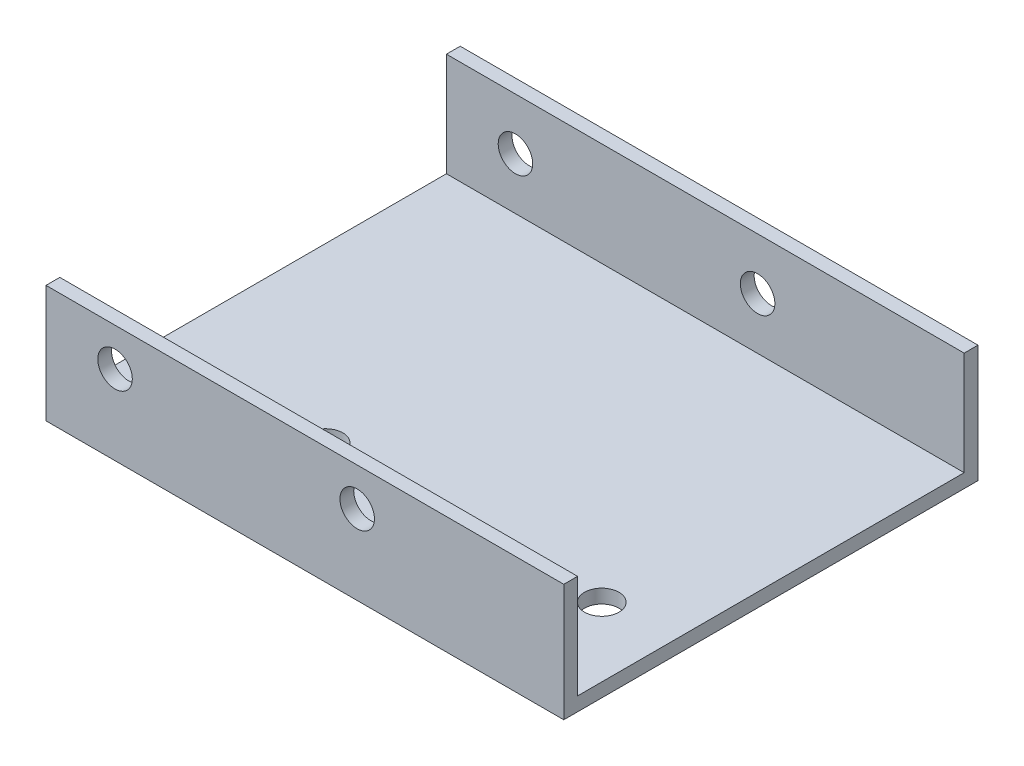
ISO-10303-21;
HEADER;
FILE_DESCRIPTION(('STEP AP214'),'2;1');
FILE_NAME('part.step','',(''),(''),'','','');
FILE_SCHEMA(('AUTOMOTIVE_DESIGN { 1 0 10303 214 1 1 1 1 }'));
ENDSEC;
DATA;
#1=APPLICATION_CONTEXT('core data for automotive mechanical design processes');
#2=APPLICATION_PROTOCOL_DEFINITION('international standard','automotive_design',2000,#1);
#3=PRODUCT_CONTEXT('',#1,'mechanical');
#4=PRODUCT('Part','Part','',(#3));
#5=PRODUCT_RELATED_PRODUCT_CATEGORY('part','',(#4));
#6=PRODUCT_DEFINITION_FORMATION('','',#4);
#7=PRODUCT_DEFINITION_CONTEXT('part definition',#1,'design');
#8=PRODUCT_DEFINITION('design','',#6,#7);
#9=PRODUCT_DEFINITION_SHAPE('','',#8);
#10=(LENGTH_UNIT() NAMED_UNIT(*) SI_UNIT(.MILLI.,.METRE.));
#11=(NAMED_UNIT(*) PLANE_ANGLE_UNIT() SI_UNIT($,.RADIAN.));
#12=(NAMED_UNIT(*) SI_UNIT($,.STERADIAN.) SOLID_ANGLE_UNIT());
#13=UNCERTAINTY_MEASURE_WITH_UNIT(LENGTH_MEASURE(1.E-05),#10,'distance_accuracy_value','');
#14=(GEOMETRIC_REPRESENTATION_CONTEXT(3) GLOBAL_UNCERTAINTY_ASSIGNED_CONTEXT((#13)) GLOBAL_UNIT_ASSIGNED_CONTEXT((#10,
#11,#12)) REPRESENTATION_CONTEXT('',''));
#15=CARTESIAN_POINT('',(0.,0.,0.));
#16=DIRECTION('',(0.,0.,1.));
#17=DIRECTION('',(1.,0.,0.));
#18=AXIS2_PLACEMENT_3D('',#15,#16,#17);
#19=CARTESIAN_POINT('',(-37.5,2.,28.));
#20=DIRECTION('',(1.,0.,0.));
#21=DIRECTION('',(0.,0.,-1.));
#22=AXIS2_PLACEMENT_3D('',#19,#20,#21);
#23=PLANE('',#22);
#24=DIRECTION('',(0.,0.,1.));
#25=VECTOR('',#24,1.);
#26=CARTESIAN_POINT('',(-37.5,0.,28.));
#27=LINE('',#26,#25);
#28=CARTESIAN_POINT('',(-37.5,0.,-30.));
#29=VERTEX_POINT('',#28);
#30=CARTESIAN_POINT('',(-37.5,0.,30.));
#31=VERTEX_POINT('',#30);
#32=EDGE_CURVE('E178',#29,#31,#27,.T.);
#33=ORIENTED_EDGE('',*,*,#32,.T.);
#34=DIRECTION('',(0.,-1.,0.));
#35=VECTOR('',#34,1.);
#36=CARTESIAN_POINT('',(-37.5,0.,30.));
#37=LINE('',#36,#35);
#38=CARTESIAN_POINT('',(-37.5,17.,30.));
#39=VERTEX_POINT('',#38);
#40=EDGE_CURVE('E148',#39,#31,#37,.T.);
#41=ORIENTED_EDGE('',*,*,#40,.F.);
#42=DIRECTION('',(0.,0.,-1.));
#43=VECTOR('',#42,1.);
#44=CARTESIAN_POINT('',(-37.5,17.,30.));
#45=LINE('',#44,#43);
#46=CARTESIAN_POINT('',(-37.5,17.,28.));
#47=VERTEX_POINT('',#46);
#48=EDGE_CURVE('E163',#39,#47,#45,.T.);
#49=ORIENTED_EDGE('',*,*,#48,.T.);
#50=DIRECTION('',(0.,-1.,0.));
#51=VECTOR('',#50,1.);
#52=CARTESIAN_POINT('',(-37.5,0.,28.));
#53=LINE('',#52,#51);
#54=CARTESIAN_POINT('',(-37.5,2.,28.));
#55=VERTEX_POINT('',#54);
#56=EDGE_CURVE('E113',#47,#55,#53,.T.);
#57=ORIENTED_EDGE('',*,*,#56,.T.);
#58=DIRECTION('',(0.,0.,1.));
#59=VECTOR('',#58,1.);
#60=CARTESIAN_POINT('',(-37.5,2.,28.));
#61=LINE('',#60,#59);
#62=CARTESIAN_POINT('',(-37.5,2.,-28.));
#63=VERTEX_POINT('',#62);
#64=EDGE_CURVE('E179',#63,#55,#61,.T.);
#65=ORIENTED_EDGE('',*,*,#64,.F.);
#66=DIRECTION('',(0.,-1.,0.));
#67=VECTOR('',#66,1.);
#68=CARTESIAN_POINT('',(-37.5,0.,-28.));
#69=LINE('',#68,#67);
#70=CARTESIAN_POINT('',(-37.5,17.,-28.));
#71=VERTEX_POINT('',#70);
#72=EDGE_CURVE('E55',#71,#63,#69,.T.);
#73=ORIENTED_EDGE('',*,*,#72,.F.);
#74=DIRECTION('',(0.,0.,1.));
#75=VECTOR('',#74,1.);
#76=CARTESIAN_POINT('',(-37.5,17.,-30.));
#77=LINE('',#76,#75);
#78=CARTESIAN_POINT('',(-37.5,17.,-30.));
#79=VERTEX_POINT('',#78);
#80=EDGE_CURVE('E104',#79,#71,#77,.T.);
#81=ORIENTED_EDGE('',*,*,#80,.F.);
#82=DIRECTION('',(0.,-1.,0.));
#83=VECTOR('',#82,1.);
#84=CARTESIAN_POINT('',(-37.5,0.,-30.));
#85=LINE('',#84,#83);
#86=EDGE_CURVE('E106',#79,#29,#85,.T.);
#87=ORIENTED_EDGE('',*,*,#86,.T.);
#88=EDGE_LOOP('',(#33,#41,#49,#57,#65,#73,#81,#87));
#89=FACE_BOUND('',#88,.T.);
#90=ADVANCED_FACE('F38',(#89),#23,.F.);
#91=CARTESIAN_POINT('',(37.5,2.,28.));
#92=DIRECTION('',(-1.,0.,0.));
#93=DIRECTION('',(0.,0.,1.));
#94=AXIS2_PLACEMENT_3D('',#91,#92,#93);
#95=PLANE('',#94);
#96=DIRECTION('',(0.,0.,-1.));
#97=VECTOR('',#96,1.);
#98=CARTESIAN_POINT('',(37.5,0.,28.));
#99=LINE('',#98,#97);
#100=CARTESIAN_POINT('',(37.5,0.,30.));
#101=VERTEX_POINT('',#100);
#102=CARTESIAN_POINT('',(37.5,0.,-30.));
#103=VERTEX_POINT('',#102);
#104=EDGE_CURVE('E41',#101,#103,#99,.T.);
#105=ORIENTED_EDGE('',*,*,#104,.T.);
#106=DIRECTION('',(0.,1.,0.));
#107=VECTOR('',#106,1.);
#108=CARTESIAN_POINT('',(37.5,0.,-30.));
#109=LINE('',#108,#107);
#110=CARTESIAN_POINT('',(37.5,17.,-30.));
#111=VERTEX_POINT('',#110);
#112=EDGE_CURVE('E130',#103,#111,#109,.T.);
#113=ORIENTED_EDGE('',*,*,#112,.T.);
#114=DIRECTION('',(0.,0.,1.));
#115=VECTOR('',#114,1.);
#116=CARTESIAN_POINT('',(37.5,17.,-30.));
#117=LINE('',#116,#115);
#118=CARTESIAN_POINT('',(37.5,17.,-28.));
#119=VERTEX_POINT('',#118);
#120=EDGE_CURVE('E114',#111,#119,#117,.T.);
#121=ORIENTED_EDGE('',*,*,#120,.T.);
#122=DIRECTION('',(0.,1.,0.));
#123=VECTOR('',#122,1.);
#124=CARTESIAN_POINT('',(37.5,0.,-28.));
#125=LINE('',#124,#123);
#126=CARTESIAN_POINT('',(37.5,2.,-28.));
#127=VERTEX_POINT('',#126);
#128=EDGE_CURVE('E125',#127,#119,#125,.T.);
#129=ORIENTED_EDGE('',*,*,#128,.F.);
#130=DIRECTION('',(0.,0.,-1.));
#131=VECTOR('',#130,1.);
#132=CARTESIAN_POINT('',(37.5,2.,28.));
#133=LINE('',#132,#131);
#134=CARTESIAN_POINT('',(37.5,2.,28.));
#135=VERTEX_POINT('',#134);
#136=EDGE_CURVE('E47',#135,#127,#133,.T.);
#137=ORIENTED_EDGE('',*,*,#136,.F.);
#138=DIRECTION('',(0.,1.,0.));
#139=VECTOR('',#138,1.);
#140=CARTESIAN_POINT('',(37.5,0.,28.));
#141=LINE('',#140,#139);
#142=CARTESIAN_POINT('',(37.5,17.,28.));
#143=VERTEX_POINT('',#142);
#144=EDGE_CURVE('E62',#135,#143,#141,.T.);
#145=ORIENTED_EDGE('',*,*,#144,.T.);
#146=DIRECTION('',(0.,0.,-1.));
#147=VECTOR('',#146,1.);
#148=CARTESIAN_POINT('',(37.5,17.,30.));
#149=LINE('',#148,#147);
#150=CARTESIAN_POINT('',(37.5,17.,30.));
#151=VERTEX_POINT('',#150);
#152=EDGE_CURVE('E174',#151,#143,#149,.T.);
#153=ORIENTED_EDGE('',*,*,#152,.F.);
#154=DIRECTION('',(0.,1.,0.));
#155=VECTOR('',#154,1.);
#156=CARTESIAN_POINT('',(37.5,0.,30.));
#157=LINE('',#156,#155);
#158=EDGE_CURVE('E157',#101,#151,#157,.T.);
#159=ORIENTED_EDGE('',*,*,#158,.F.);
#160=EDGE_LOOP('',(#105,#113,#121,#129,#137,#145,#153,#159));
#161=FACE_BOUND('',#160,.T.);
#162=ADVANCED_FACE('F194',(#161),#95,.F.);
#163=CARTESIAN_POINT('',(0.,2.,0.));
#164=DIRECTION('',(0.,1.,0.));
#165=DIRECTION('',(0.,0.,1.));
#166=AXIS2_PLACEMENT_3D('',#163,#164,#165);
#167=PLANE('',#166);
#168=CARTESIAN_POINT('',(-12.5,2.,14.4999999999989));
#169=DIRECTION('',(0.,1.,0.));
#170=DIRECTION('',(0.,0.,1.));
#171=AXIS2_PLACEMENT_3D('',#168,#169,#170);
#172=CIRCLE('',#171,2.5);
#173=CARTESIAN_POINT('',(-12.5,2.,16.9999999999989));
#174=VERTEX_POINT('',#173);
#175=EDGE_CURVE('E276',#174,#174,#172,.T.);
#176=ORIENTED_EDGE('',*,*,#175,.F.);
#177=EDGE_LOOP('',(#176));
#178=FACE_BOUND('',#177,.T.);
#179=CARTESIAN_POINT('',(27.5,2.,14.4999999999989));
#180=DIRECTION('',(0.,1.,0.));
#181=DIRECTION('',(0.,0.,1.));
#182=AXIS2_PLACEMENT_3D('',#179,#180,#181);
#183=CIRCLE('',#182,2.5);
#184=CARTESIAN_POINT('',(27.5,2.,16.9999999999989));
#185=VERTEX_POINT('',#184);
#186=EDGE_CURVE('E267',#185,#185,#183,.T.);
#187=ORIENTED_EDGE('',*,*,#186,.F.);
#188=EDGE_LOOP('',(#187));
#189=FACE_BOUND('',#188,.T.);
#190=ORIENTED_EDGE('',*,*,#64,.T.);
#191=DIRECTION('',(1.,0.,0.));
#192=VECTOR('',#191,1.);
#193=CARTESIAN_POINT('',(37.5,2.,28.));
#194=LINE('',#193,#192);
#195=EDGE_CURVE('E183',#55,#135,#194,.T.);
#196=ORIENTED_EDGE('',*,*,#195,.T.);
#197=ORIENTED_EDGE('',*,*,#136,.T.);
#198=DIRECTION('',(-1.,0.,0.));
#199=VECTOR('',#198,1.);
#200=CARTESIAN_POINT('',(37.5,2.,-28.));
#201=LINE('',#200,#199);
#202=EDGE_CURVE('E11',#127,#63,#201,.T.);
#203=ORIENTED_EDGE('',*,*,#202,.T.);
#204=EDGE_LOOP('',(#190,#196,#197,#203));
#205=FACE_BOUND('',#204,.T.);
#206=ADVANCED_FACE('F207',(#178,#189,#205),#167,.T.);
#207=CARTESIAN_POINT('',(0.,0.,0.));
#208=DIRECTION('',(0.,1.,0.));
#209=DIRECTION('',(0.,0.,1.));
#210=AXIS2_PLACEMENT_3D('',#207,#208,#209);
#211=PLANE('',#210);
#212=CARTESIAN_POINT('',(-12.5,0.,14.4999999999989));
#213=DIRECTION('',(0.,1.,0.));
#214=DIRECTION('',(0.,0.,1.));
#215=AXIS2_PLACEMENT_3D('',#212,#213,#214);
#216=CIRCLE('',#215,2.5);
#217=CARTESIAN_POINT('',(-12.5,0.,16.9999999999989));
#218=VERTEX_POINT('',#217);
#219=EDGE_CURVE('E266',#218,#218,#216,.T.);
#220=ORIENTED_EDGE('',*,*,#219,.T.);
#221=EDGE_LOOP('',(#220));
#222=FACE_BOUND('',#221,.T.);
#223=CARTESIAN_POINT('',(27.5,0.,14.4999999999989));
#224=DIRECTION('',(0.,1.,0.));
#225=DIRECTION('',(0.,0.,1.));
#226=AXIS2_PLACEMENT_3D('',#223,#224,#225);
#227=CIRCLE('',#226,2.5);
#228=CARTESIAN_POINT('',(27.5,0.,16.9999999999989));
#229=VERTEX_POINT('',#228);
#230=EDGE_CURVE('E271',#229,#229,#227,.T.);
#231=ORIENTED_EDGE('',*,*,#230,.T.);
#232=EDGE_LOOP('',(#231));
#233=FACE_BOUND('',#232,.T.);
#234=ORIENTED_EDGE('',*,*,#32,.F.);
#235=DIRECTION('',(1.,0.,0.));
#236=VECTOR('',#235,1.);
#237=CARTESIAN_POINT('',(-37.5,0.,-30.));
#238=LINE('',#237,#236);
#239=EDGE_CURVE('E123',#29,#103,#238,.T.);
#240=ORIENTED_EDGE('',*,*,#239,.T.);
#241=ORIENTED_EDGE('',*,*,#104,.F.);
#242=DIRECTION('',(1.,0.,0.));
#243=VECTOR('',#242,1.);
#244=CARTESIAN_POINT('',(-37.5,0.,30.));
#245=LINE('',#244,#243);
#246=EDGE_CURVE('E152',#31,#101,#245,.T.);
#247=ORIENTED_EDGE('',*,*,#246,.F.);
#248=EDGE_LOOP('',(#234,#240,#241,#247));
#249=FACE_BOUND('',#248,.T.);
#250=ADVANCED_FACE('F197',(#222,#233,#249),#211,.F.);
#251=CARTESIAN_POINT('',(0.,0.,28.));
#252=DIRECTION('',(0.,0.,-1.));
#253=DIRECTION('',(-1.,0.,0.));
#254=AXIS2_PLACEMENT_3D('',#251,#252,#253);
#255=PLANE('',#254);
#256=CARTESIAN_POINT('',(-27.5,11.5,28.));
#257=DIRECTION('',(0.,0.,-1.));
#258=DIRECTION('',(-1.,0.,0.));
#259=AXIS2_PLACEMENT_3D('',#256,#257,#258);
#260=CIRCLE('',#259,2.5);
#261=CARTESIAN_POINT('',(-30.,11.5,28.));
#262=VERTEX_POINT('',#261);
#263=EDGE_CURVE('E250',#262,#262,#260,.F.);
#264=ORIENTED_EDGE('',*,*,#263,.T.);
#265=EDGE_LOOP('',(#264));
#266=FACE_BOUND('',#265,.T.);
#267=CARTESIAN_POINT('',(7.57500000000002,11.5,28.));
#268=DIRECTION('',(0.,0.,-1.));
#269=DIRECTION('',(-1.,0.,0.));
#270=AXIS2_PLACEMENT_3D('',#267,#268,#269);
#271=CIRCLE('',#270,2.5);
#272=CARTESIAN_POINT('',(5.07500000000002,11.5,28.));
#273=VERTEX_POINT('',#272);
#274=EDGE_CURVE('E253',#273,#273,#271,.T.);
#275=ORIENTED_EDGE('',*,*,#274,.F.);
#276=EDGE_LOOP('',(#275));
#277=FACE_BOUND('',#276,.T.);
#278=ORIENTED_EDGE('',*,*,#195,.F.);
#279=ORIENTED_EDGE('',*,*,#56,.F.);
#280=DIRECTION('',(-1.,0.,0.));
#281=VECTOR('',#280,1.);
#282=CARTESIAN_POINT('',(-37.5,17.,28.));
#283=LINE('',#282,#281);
#284=EDGE_CURVE('E153',#143,#47,#283,.T.);
#285=ORIENTED_EDGE('',*,*,#284,.F.);
#286=ORIENTED_EDGE('',*,*,#144,.F.);
#287=EDGE_LOOP('',(#278,#279,#285,#286));
#288=FACE_BOUND('',#287,.T.);
#289=ADVANCED_FACE('F204',(#266,#277,#288),#255,.T.);
#290=CARTESIAN_POINT('',(-37.5,17.,30.));
#291=DIRECTION('',(0.,-1.,0.));
#292=DIRECTION('',(0.,0.,-1.));
#293=AXIS2_PLACEMENT_3D('',#290,#291,#292);
#294=PLANE('',#293);
#295=ORIENTED_EDGE('',*,*,#284,.T.);
#296=ORIENTED_EDGE('',*,*,#48,.F.);
#297=DIRECTION('',(-1.,0.,0.));
#298=VECTOR('',#297,1.);
#299=CARTESIAN_POINT('',(-37.5,17.,30.));
#300=LINE('',#299,#298);
#301=EDGE_CURVE('E160',#151,#39,#300,.T.);
#302=ORIENTED_EDGE('',*,*,#301,.F.);
#303=ORIENTED_EDGE('',*,*,#152,.T.);
#304=EDGE_LOOP('',(#295,#296,#302,#303));
#305=FACE_BOUND('',#304,.T.);
#306=ADVANCED_FACE('F220',(#305),#294,.F.);
#307=CARTESIAN_POINT('',(0.,0.,30.));
#308=DIRECTION('',(0.,0.,-1.));
#309=DIRECTION('',(-1.,0.,0.));
#310=AXIS2_PLACEMENT_3D('',#307,#308,#309);
#311=PLANE('',#310);
#312=CARTESIAN_POINT('',(-27.5,11.5,30.));
#313=DIRECTION('',(0.,0.,1.));
#314=DIRECTION('',(1.,0.,0.));
#315=AXIS2_PLACEMENT_3D('',#312,#313,#314);
#316=CIRCLE('',#315,2.5);
#317=CARTESIAN_POINT('',(-25.,11.5,30.));
#318=VERTEX_POINT('',#317);
#319=EDGE_CURVE('E256',#318,#318,#316,.T.);
#320=ORIENTED_EDGE('',*,*,#319,.F.);
#321=EDGE_LOOP('',(#320));
#322=FACE_BOUND('',#321,.T.);
#323=CARTESIAN_POINT('',(7.57500000000002,11.5,30.));
#324=DIRECTION('',(0.,0.,-1.));
#325=DIRECTION('',(-1.,0.,0.));
#326=AXIS2_PLACEMENT_3D('',#323,#324,#325);
#327=CIRCLE('',#326,2.5);
#328=CARTESIAN_POINT('',(5.07500000000002,11.5,30.));
#329=VERTEX_POINT('',#328);
#330=EDGE_CURVE('E141',#329,#329,#327,.F.);
#331=ORIENTED_EDGE('',*,*,#330,.F.);
#332=EDGE_LOOP('',(#331));
#333=FACE_BOUND('',#332,.T.);
#334=ORIENTED_EDGE('',*,*,#40,.T.);
#335=ORIENTED_EDGE('',*,*,#246,.T.);
#336=ORIENTED_EDGE('',*,*,#158,.T.);
#337=ORIENTED_EDGE('',*,*,#301,.T.);
#338=EDGE_LOOP('',(#334,#335,#336,#337));
#339=FACE_BOUND('',#338,.T.);
#340=ADVANCED_FACE('F199',(#322,#333,#339),#311,.F.);
#341=CARTESIAN_POINT('',(0.,0.,-28.));
#342=DIRECTION('',(0.,0.,1.));
#343=DIRECTION('',(-1.,0.,0.));
#344=AXIS2_PLACEMENT_3D('',#341,#342,#343);
#345=PLANE('',#344);
#346=CARTESIAN_POINT('',(-27.5,9.5,-28.));
#347=DIRECTION('',(0.,0.,1.));
#348=DIRECTION('',(1.,0.,0.));
#349=AXIS2_PLACEMENT_3D('',#346,#347,#348);
#350=CIRCLE('',#349,2.5);
#351=CARTESIAN_POINT('',(-25.,9.5,-28.));
#352=VERTEX_POINT('',#351);
#353=EDGE_CURVE('E294',#352,#352,#350,.F.);
#354=ORIENTED_EDGE('',*,*,#353,.T.);
#355=EDGE_LOOP('',(#354));
#356=FACE_BOUND('',#355,.T.);
#357=CARTESIAN_POINT('',(7.57500000000002,9.5,-28.));
#358=DIRECTION('',(0.,0.,1.));
#359=DIRECTION('',(1.,0.,0.));
#360=AXIS2_PLACEMENT_3D('',#357,#358,#359);
#361=CIRCLE('',#360,2.5);
#362=CARTESIAN_POINT('',(10.075,9.5,-28.));
#363=VERTEX_POINT('',#362);
#364=EDGE_CURVE('E286',#363,#363,#361,.F.);
#365=ORIENTED_EDGE('',*,*,#364,.T.);
#366=EDGE_LOOP('',(#365));
#367=FACE_BOUND('',#366,.T.);
#368=ORIENTED_EDGE('',*,*,#202,.F.);
#369=ORIENTED_EDGE('',*,*,#128,.T.);
#370=DIRECTION('',(-1.,0.,0.));
#371=VECTOR('',#370,1.);
#372=CARTESIAN_POINT('',(-37.5,17.,-28.));
#373=LINE('',#372,#371);
#374=EDGE_CURVE('E140',#119,#71,#373,.T.);
#375=ORIENTED_EDGE('',*,*,#374,.T.);
#376=ORIENTED_EDGE('',*,*,#72,.T.);
#377=EDGE_LOOP('',(#368,#369,#375,#376));
#378=FACE_BOUND('',#377,.T.);
#379=ADVANCED_FACE('F209',(#356,#367,#378),#345,.T.);
#380=CARTESIAN_POINT('',(-37.5,17.,-30.));
#381=DIRECTION('',(0.,1.,0.));
#382=DIRECTION('',(0.,0.,1.));
#383=AXIS2_PLACEMENT_3D('',#380,#381,#382);
#384=PLANE('',#383);
#385=ORIENTED_EDGE('',*,*,#374,.F.);
#386=ORIENTED_EDGE('',*,*,#120,.F.);
#387=DIRECTION('',(-1.,0.,0.));
#388=VECTOR('',#387,1.);
#389=CARTESIAN_POINT('',(-37.5,17.,-30.));
#390=LINE('',#389,#388);
#391=EDGE_CURVE('E120',#111,#79,#390,.T.);
#392=ORIENTED_EDGE('',*,*,#391,.T.);
#393=ORIENTED_EDGE('',*,*,#80,.T.);
#394=EDGE_LOOP('',(#385,#386,#392,#393));
#395=FACE_BOUND('',#394,.T.);
#396=ADVANCED_FACE('F127',(#395),#384,.T.);
#397=CARTESIAN_POINT('',(0.,0.,-30.));
#398=DIRECTION('',(0.,0.,1.));
#399=DIRECTION('',(-1.,0.,0.));
#400=AXIS2_PLACEMENT_3D('',#397,#398,#399);
#401=PLANE('',#400);
#402=CARTESIAN_POINT('',(-27.5,9.5,-30.));
#403=DIRECTION('',(0.,0.,-1.));
#404=DIRECTION('',(-1.,0.,0.));
#405=AXIS2_PLACEMENT_3D('',#402,#403,#404);
#406=CIRCLE('',#405,2.5);
#407=CARTESIAN_POINT('',(-30.,9.5,-30.));
#408=VERTEX_POINT('',#407);
#409=EDGE_CURVE('E290',#408,#408,#406,.T.);
#410=ORIENTED_EDGE('',*,*,#409,.F.);
#411=EDGE_LOOP('',(#410));
#412=FACE_BOUND('',#411,.T.);
#413=CARTESIAN_POINT('',(7.57500000000002,9.5,-30.));
#414=DIRECTION('',(0.,0.,-1.));
#415=DIRECTION('',(-1.,0.,0.));
#416=AXIS2_PLACEMENT_3D('',#413,#414,#415);
#417=CIRCLE('',#416,2.5);
#418=CARTESIAN_POINT('',(5.07500000000002,9.5,-30.));
#419=VERTEX_POINT('',#418);
#420=EDGE_CURVE('E272',#419,#419,#417,.T.);
#421=ORIENTED_EDGE('',*,*,#420,.F.);
#422=EDGE_LOOP('',(#421));
#423=FACE_BOUND('',#422,.T.);
#424=ORIENTED_EDGE('',*,*,#86,.F.);
#425=ORIENTED_EDGE('',*,*,#391,.F.);
#426=ORIENTED_EDGE('',*,*,#112,.F.);
#427=ORIENTED_EDGE('',*,*,#239,.F.);
#428=EDGE_LOOP('',(#424,#425,#426,#427));
#429=FACE_BOUND('',#428,.T.);
#430=ADVANCED_FACE('F118',(#412,#423,#429),#401,.F.);
#431=CARTESIAN_POINT('',(7.57500000000002,11.5,30.001));
#432=DIRECTION('',(0.,0.,-1.));
#433=DIRECTION('',(-1.,0.,0.));
#434=AXIS2_PLACEMENT_3D('',#431,#432,#433);
#435=CYLINDRICAL_SURFACE('',#434,2.5);
#436=ORIENTED_EDGE('',*,*,#274,.T.);
#437=EDGE_LOOP('',(#436));
#438=FACE_BOUND('',#437,.T.);
#439=ORIENTED_EDGE('',*,*,#330,.T.);
#440=EDGE_LOOP('',(#439));
#441=FACE_BOUND('',#440,.T.);
#442=ADVANCED_FACE('F306',(#438,#441),#435,.F.);
#443=CARTESIAN_POINT('',(-27.5,11.5,-30.001));
#444=DIRECTION('',(0.,0.,1.));
#445=DIRECTION('',(1.,0.,0.));
#446=AXIS2_PLACEMENT_3D('',#443,#444,#445);
#447=CYLINDRICAL_SURFACE('',#446,2.5);
#448=ORIENTED_EDGE('',*,*,#263,.F.);
#449=EDGE_LOOP('',(#448));
#450=FACE_BOUND('',#449,.T.);
#451=ORIENTED_EDGE('',*,*,#319,.T.);
#452=EDGE_LOOP('',(#451));
#453=FACE_BOUND('',#452,.T.);
#454=ADVANCED_FACE('F322',(#450,#453),#447,.F.);
#455=CARTESIAN_POINT('',(27.5,0.,14.4999999999989));
#456=DIRECTION('',(0.,1.,0.));
#457=DIRECTION('',(0.,0.,1.));
#458=AXIS2_PLACEMENT_3D('',#455,#456,#457);
#459=CYLINDRICAL_SURFACE('',#458,2.5);
#460=ORIENTED_EDGE('',*,*,#230,.F.);
#461=EDGE_LOOP('',(#460));
#462=FACE_BOUND('',#461,.T.);
#463=ORIENTED_EDGE('',*,*,#186,.T.);
#464=EDGE_LOOP('',(#463));
#465=FACE_BOUND('',#464,.T.);
#466=ADVANCED_FACE('F315',(#462,#465),#459,.F.);
#467=CARTESIAN_POINT('',(-12.5,0.,14.4999999999989));
#468=DIRECTION('',(0.,1.,0.));
#469=DIRECTION('',(0.,0.,1.));
#470=AXIS2_PLACEMENT_3D('',#467,#468,#469);
#471=CYLINDRICAL_SURFACE('',#470,2.5);
#472=ORIENTED_EDGE('',*,*,#219,.F.);
#473=EDGE_LOOP('',(#472));
#474=FACE_BOUND('',#473,.T.);
#475=ORIENTED_EDGE('',*,*,#175,.T.);
#476=EDGE_LOOP('',(#475));
#477=FACE_BOUND('',#476,.T.);
#478=ADVANCED_FACE('F310',(#474,#477),#471,.F.);
#479=CARTESIAN_POINT('',(7.57500000000002,9.5,30.001));
#480=DIRECTION('',(0.,0.,-1.));
#481=DIRECTION('',(-1.,0.,0.));
#482=AXIS2_PLACEMENT_3D('',#479,#480,#481);
#483=CYLINDRICAL_SURFACE('',#482,2.5);
#484=ORIENTED_EDGE('',*,*,#364,.F.);
#485=EDGE_LOOP('',(#484));
#486=FACE_BOUND('',#485,.T.);
#487=ORIENTED_EDGE('',*,*,#420,.T.);
#488=EDGE_LOOP('',(#487));
#489=FACE_BOUND('',#488,.T.);
#490=ADVANCED_FACE('F301',(#486,#489),#483,.F.);
#491=CARTESIAN_POINT('',(-27.5,9.5,30.001));
#492=DIRECTION('',(0.,0.,-1.));
#493=DIRECTION('',(-1.,0.,0.));
#494=AXIS2_PLACEMENT_3D('',#491,#492,#493);
#495=CYLINDRICAL_SURFACE('',#494,2.5);
#496=ORIENTED_EDGE('',*,*,#353,.F.);
#497=EDGE_LOOP('',(#496));
#498=FACE_BOUND('',#497,.T.);
#499=ORIENTED_EDGE('',*,*,#409,.T.);
#500=EDGE_LOOP('',(#499));
#501=FACE_BOUND('',#500,.T.);
#502=ADVANCED_FACE('F298',(#498,#501),#495,.F.);
#503=CLOSED_SHELL('',(#90,#162,#206,#250,#289,#306,#340,#379,#396,#430,#442,#454,#466,#478,#490,#502));
#504=MANIFOLD_SOLID_BREP('B2',#503);
#505=ADVANCED_BREP_SHAPE_REPRESENTATION('',(#18,#504),#14);
#506=SHAPE_DEFINITION_REPRESENTATION(#9,#505);
ENDSEC;
END-ISO-10303-21;
